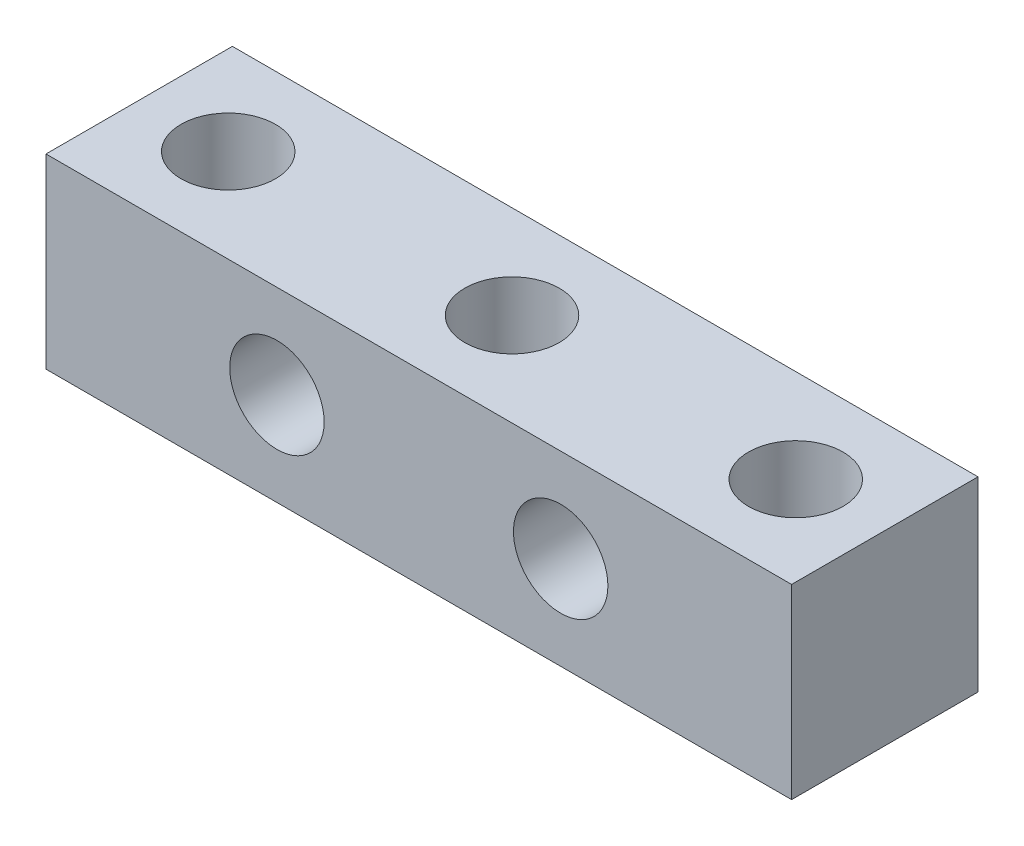
ISO-10303-21;
HEADER;
FILE_DESCRIPTION(('STEP AP214'),'2;1');
FILE_NAME('part.step','',(''),(''),'','','');
FILE_SCHEMA(('AUTOMOTIVE_DESIGN { 1 0 10303 214 1 1 1 1 }'));
ENDSEC;
DATA;
#1=APPLICATION_CONTEXT('core data for automotive mechanical design processes');
#2=APPLICATION_PROTOCOL_DEFINITION('international standard','automotive_design',2000,#1);
#3=PRODUCT_CONTEXT('',#1,'mechanical');
#4=PRODUCT('Part','Part','',(#3));
#5=PRODUCT_RELATED_PRODUCT_CATEGORY('part','',(#4));
#6=PRODUCT_DEFINITION_FORMATION('','',#4);
#7=PRODUCT_DEFINITION_CONTEXT('part definition',#1,'design');
#8=PRODUCT_DEFINITION('design','',#6,#7);
#9=PRODUCT_DEFINITION_SHAPE('','',#8);
#10=(LENGTH_UNIT() NAMED_UNIT(*) SI_UNIT(.MILLI.,.METRE.));
#11=(NAMED_UNIT(*) PLANE_ANGLE_UNIT() SI_UNIT($,.RADIAN.));
#12=(NAMED_UNIT(*) SI_UNIT($,.STERADIAN.) SOLID_ANGLE_UNIT());
#13=UNCERTAINTY_MEASURE_WITH_UNIT(LENGTH_MEASURE(1.E-05),#10,'distance_accuracy_value','');
#14=(GEOMETRIC_REPRESENTATION_CONTEXT(3) GLOBAL_UNCERTAINTY_ASSIGNED_CONTEXT((#13)) GLOBAL_UNIT_ASSIGNED_CONTEXT((#10,
#11,#12)) REPRESENTATION_CONTEXT('',''));
#15=CARTESIAN_POINT('',(0.,0.,0.));
#16=DIRECTION('',(0.,0.,1.));
#17=DIRECTION('',(1.,0.,0.));
#18=AXIS2_PLACEMENT_3D('',#15,#16,#17);
#19=CARTESIAN_POINT('',(38.1,4.7625,4.7625));
#20=DIRECTION('',(0.,0.,-1.));
#21=DIRECTION('',(0.,1.,0.));
#22=AXIS2_PLACEMENT_3D('',#19,#20,#21);
#23=PLANE('',#22);
#24=CARTESIAN_POINT('',(11.8,0.,4.7625));
#25=DIRECTION('',(0.,0.,1.));
#26=DIRECTION('',(1.,0.,0.));
#27=AXIS2_PLACEMENT_3D('',#24,#25,#26);
#28=CIRCLE('',#27,2.41299999999999);
#29=CARTESIAN_POINT('',(14.213,0.,4.7625));
#30=VERTEX_POINT('',#29);
#31=EDGE_CURVE('E137',#30,#30,#28,.T.);
#32=ORIENTED_EDGE('',*,*,#31,.F.);
#33=EDGE_LOOP('',(#32));
#34=FACE_BOUND('',#33,.T.);
#35=CARTESIAN_POINT('',(26.3,0.,4.7625));
#36=DIRECTION('',(0.,0.,1.));
#37=DIRECTION('',(1.,0.,0.));
#38=AXIS2_PLACEMENT_3D('',#35,#36,#37);
#39=CIRCLE('',#38,2.41299999999999);
#40=CARTESIAN_POINT('',(28.713,0.,4.7625));
#41=VERTEX_POINT('',#40);
#42=EDGE_CURVE('E131',#41,#41,#39,.T.);
#43=ORIENTED_EDGE('',*,*,#42,.F.);
#44=EDGE_LOOP('',(#43));
#45=FACE_BOUND('',#44,.T.);
#46=DIRECTION('',(0.,-1.,0.));
#47=VECTOR('',#46,1.);
#48=CARTESIAN_POINT('',(0.,4.7625,4.7625));
#49=LINE('',#48,#47);
#50=CARTESIAN_POINT('',(0.,4.7625,4.7625));
#51=VERTEX_POINT('',#50);
#52=CARTESIAN_POINT('',(0.,-4.7625,4.7625));
#53=VERTEX_POINT('',#52);
#54=EDGE_CURVE('E97',#51,#53,#49,.T.);
#55=ORIENTED_EDGE('',*,*,#54,.T.);
#56=DIRECTION('',(-1.,0.,0.));
#57=VECTOR('',#56,1.);
#58=CARTESIAN_POINT('',(38.1,-4.7625,4.7625));
#59=LINE('',#58,#57);
#60=CARTESIAN_POINT('',(38.1,-4.7625,4.7625));
#61=VERTEX_POINT('',#60);
#62=EDGE_CURVE('E11',#61,#53,#59,.T.);
#63=ORIENTED_EDGE('',*,*,#62,.F.);
#64=DIRECTION('',(0.,-1.,0.));
#65=VECTOR('',#64,1.);
#66=CARTESIAN_POINT('',(38.1,4.7625,4.7625));
#67=LINE('',#66,#65);
#68=CARTESIAN_POINT('',(38.1,4.7625,4.7625));
#69=VERTEX_POINT('',#68);
#70=EDGE_CURVE('E85',#69,#61,#67,.T.);
#71=ORIENTED_EDGE('',*,*,#70,.F.);
#72=DIRECTION('',(-1.,0.,0.));
#73=VECTOR('',#72,1.);
#74=CARTESIAN_POINT('',(38.1,4.7625,4.7625));
#75=LINE('',#74,#73);
#76=EDGE_CURVE('E93',#69,#51,#75,.T.);
#77=ORIENTED_EDGE('',*,*,#76,.T.);
#78=EDGE_LOOP('',(#55,#63,#71,#77));
#79=FACE_BOUND('',#78,.T.);
#80=ADVANCED_FACE('F34',(#34,#45,#79),#23,.F.);
#81=CARTESIAN_POINT('',(38.1,-4.7625,4.7625));
#82=DIRECTION('',(0.,1.,0.));
#83=DIRECTION('',(0.,0.,1.));
#84=AXIS2_PLACEMENT_3D('',#81,#82,#83);
#85=PLANE('',#84);
#86=CARTESIAN_POINT('',(4.55,-4.7625,0.));
#87=DIRECTION('',(0.,1.,0.));
#88=DIRECTION('',(0.,0.,1.));
#89=AXIS2_PLACEMENT_3D('',#86,#87,#88);
#90=CIRCLE('',#89,2.413);
#91=CARTESIAN_POINT('',(4.55,-4.7625,2.413));
#92=VERTEX_POINT('',#91);
#93=EDGE_CURVE('E122',#92,#92,#90,.T.);
#94=ORIENTED_EDGE('',*,*,#93,.T.);
#95=EDGE_LOOP('',(#94));
#96=FACE_BOUND('',#95,.T.);
#97=CARTESIAN_POINT('',(19.05,-4.7625,0.));
#98=DIRECTION('',(0.,1.,0.));
#99=DIRECTION('',(0.,0.,1.));
#100=AXIS2_PLACEMENT_3D('',#97,#98,#99);
#101=CIRCLE('',#100,2.413);
#102=CARTESIAN_POINT('',(19.05,-4.7625,2.413));
#103=VERTEX_POINT('',#102);
#104=EDGE_CURVE('E116',#103,#103,#101,.T.);
#105=ORIENTED_EDGE('',*,*,#104,.T.);
#106=EDGE_LOOP('',(#105));
#107=FACE_BOUND('',#106,.T.);
#108=CARTESIAN_POINT('',(33.55,-4.7625,0.));
#109=DIRECTION('',(0.,1.,0.));
#110=DIRECTION('',(0.,0.,1.));
#111=AXIS2_PLACEMENT_3D('',#108,#109,#110);
#112=CIRCLE('',#111,2.413);
#113=CARTESIAN_POINT('',(33.55,-4.7625,2.413));
#114=VERTEX_POINT('',#113);
#115=EDGE_CURVE('E100',#114,#114,#112,.T.);
#116=ORIENTED_EDGE('',*,*,#115,.T.);
#117=EDGE_LOOP('',(#116));
#118=FACE_BOUND('',#117,.T.);
#119=DIRECTION('',(0.,0.,-1.));
#120=VECTOR('',#119,1.);
#121=CARTESIAN_POINT('',(0.,-4.7625,4.7625));
#122=LINE('',#121,#120);
#123=CARTESIAN_POINT('',(0.,-4.7625,-4.7625));
#124=VERTEX_POINT('',#123);
#125=EDGE_CURVE('E89',#53,#124,#122,.T.);
#126=ORIENTED_EDGE('',*,*,#125,.T.);
#127=DIRECTION('',(-1.,0.,0.));
#128=VECTOR('',#127,1.);
#129=CARTESIAN_POINT('',(38.1,-4.7625,-4.7625));
#130=LINE('',#129,#128);
#131=CARTESIAN_POINT('',(38.1,-4.7625,-4.7625));
#132=VERTEX_POINT('',#131);
#133=EDGE_CURVE('E42',#132,#124,#130,.T.);
#134=ORIENTED_EDGE('',*,*,#133,.F.);
#135=DIRECTION('',(0.,0.,-1.));
#136=VECTOR('',#135,1.);
#137=CARTESIAN_POINT('',(38.1,-4.7625,4.7625));
#138=LINE('',#137,#136);
#139=EDGE_CURVE('E80',#61,#132,#138,.T.);
#140=ORIENTED_EDGE('',*,*,#139,.F.);
#141=ORIENTED_EDGE('',*,*,#62,.T.);
#142=EDGE_LOOP('',(#126,#134,#140,#141));
#143=FACE_BOUND('',#142,.T.);
#144=ADVANCED_FACE('F88',(#96,#107,#118,#143),#85,.F.);
#145=CARTESIAN_POINT('',(38.1,4.7625,-4.7625));
#146=DIRECTION('',(0.,0.,1.));
#147=DIRECTION('',(1.,0.,0.));
#148=AXIS2_PLACEMENT_3D('',#145,#146,#147);
#149=PLANE('',#148);
#150=CARTESIAN_POINT('',(11.8,0.,-4.7625));
#151=DIRECTION('',(0.,0.,1.));
#152=DIRECTION('',(1.,0.,0.));
#153=AXIS2_PLACEMENT_3D('',#150,#151,#152);
#154=CIRCLE('',#153,2.413);
#155=CARTESIAN_POINT('',(14.213,0.,-4.7625));
#156=VERTEX_POINT('',#155);
#157=EDGE_CURVE('E134',#156,#156,#154,.T.);
#158=ORIENTED_EDGE('',*,*,#157,.T.);
#159=EDGE_LOOP('',(#158));
#160=FACE_BOUND('',#159,.T.);
#161=CARTESIAN_POINT('',(26.3,0.,-4.7625));
#162=DIRECTION('',(0.,0.,1.));
#163=DIRECTION('',(1.,0.,0.));
#164=AXIS2_PLACEMENT_3D('',#161,#162,#163);
#165=CIRCLE('',#164,2.413);
#166=CARTESIAN_POINT('',(28.713,0.,-4.7625));
#167=VERTEX_POINT('',#166);
#168=EDGE_CURVE('E128',#167,#167,#165,.T.);
#169=ORIENTED_EDGE('',*,*,#168,.T.);
#170=EDGE_LOOP('',(#169));
#171=FACE_BOUND('',#170,.T.);
#172=DIRECTION('',(0.,1.,0.));
#173=VECTOR('',#172,1.);
#174=CARTESIAN_POINT('',(0.,4.7625,-4.7625));
#175=LINE('',#174,#173);
#176=CARTESIAN_POINT('',(0.,4.7625,-4.7625));
#177=VERTEX_POINT('',#176);
#178=EDGE_CURVE('E67',#124,#177,#175,.T.);
#179=ORIENTED_EDGE('',*,*,#178,.T.);
#180=DIRECTION('',(-1.,0.,0.));
#181=VECTOR('',#180,1.);
#182=CARTESIAN_POINT('',(38.1,4.7625,-4.7625));
#183=LINE('',#182,#181);
#184=CARTESIAN_POINT('',(38.1,4.7625,-4.7625));
#185=VERTEX_POINT('',#184);
#186=EDGE_CURVE('E90',#185,#177,#183,.T.);
#187=ORIENTED_EDGE('',*,*,#186,.F.);
#188=DIRECTION('',(0.,1.,0.));
#189=VECTOR('',#188,1.);
#190=CARTESIAN_POINT('',(38.1,4.7625,-4.7625));
#191=LINE('',#190,#189);
#192=EDGE_CURVE('E83',#132,#185,#191,.T.);
#193=ORIENTED_EDGE('',*,*,#192,.F.);
#194=ORIENTED_EDGE('',*,*,#133,.T.);
#195=EDGE_LOOP('',(#179,#187,#193,#194));
#196=FACE_BOUND('',#195,.T.);
#197=ADVANCED_FACE('F91',(#160,#171,#196),#149,.F.);
#198=CARTESIAN_POINT('',(38.1,4.7625,4.7625));
#199=DIRECTION('',(0.,-1.,0.));
#200=DIRECTION('',(0.,0.,-1.));
#201=AXIS2_PLACEMENT_3D('',#198,#199,#200);
#202=PLANE('',#201);
#203=CARTESIAN_POINT('',(4.55,4.7625,0.));
#204=DIRECTION('',(0.,1.,0.));
#205=DIRECTION('',(0.,0.,1.));
#206=AXIS2_PLACEMENT_3D('',#203,#204,#205);
#207=CIRCLE('',#206,2.41299999999999);
#208=CARTESIAN_POINT('',(4.55,4.7625,2.41299999999999));
#209=VERTEX_POINT('',#208);
#210=EDGE_CURVE('E125',#209,#209,#207,.T.);
#211=ORIENTED_EDGE('',*,*,#210,.F.);
#212=EDGE_LOOP('',(#211));
#213=FACE_BOUND('',#212,.T.);
#214=CARTESIAN_POINT('',(19.05,4.7625,0.));
#215=DIRECTION('',(0.,1.,0.));
#216=DIRECTION('',(0.,0.,1.));
#217=AXIS2_PLACEMENT_3D('',#214,#215,#216);
#218=CIRCLE('',#217,2.41299999999999);
#219=CARTESIAN_POINT('',(19.05,4.7625,2.41299999999999));
#220=VERTEX_POINT('',#219);
#221=EDGE_CURVE('E119',#220,#220,#218,.T.);
#222=ORIENTED_EDGE('',*,*,#221,.F.);
#223=EDGE_LOOP('',(#222));
#224=FACE_BOUND('',#223,.T.);
#225=CARTESIAN_POINT('',(33.55,4.7625,0.));
#226=DIRECTION('',(0.,1.,0.));
#227=DIRECTION('',(0.,0.,1.));
#228=AXIS2_PLACEMENT_3D('',#225,#226,#227);
#229=CIRCLE('',#228,2.41299999999999);
#230=CARTESIAN_POINT('',(33.55,4.7625,2.41299999999999));
#231=VERTEX_POINT('',#230);
#232=EDGE_CURVE('E113',#231,#231,#229,.T.);
#233=ORIENTED_EDGE('',*,*,#232,.F.);
#234=EDGE_LOOP('',(#233));
#235=FACE_BOUND('',#234,.T.);
#236=DIRECTION('',(0.,0.,1.));
#237=VECTOR('',#236,1.);
#238=CARTESIAN_POINT('',(0.,4.7625,4.7625));
#239=LINE('',#238,#237);
#240=EDGE_CURVE('E73',#177,#51,#239,.T.);
#241=ORIENTED_EDGE('',*,*,#240,.T.);
#242=ORIENTED_EDGE('',*,*,#76,.F.);
#243=DIRECTION('',(0.,0.,1.));
#244=VECTOR('',#243,1.);
#245=CARTESIAN_POINT('',(38.1,4.7625,4.7625));
#246=LINE('',#245,#244);
#247=EDGE_CURVE('E50',#185,#69,#246,.T.);
#248=ORIENTED_EDGE('',*,*,#247,.F.);
#249=ORIENTED_EDGE('',*,*,#186,.T.);
#250=EDGE_LOOP('',(#241,#242,#248,#249));
#251=FACE_BOUND('',#250,.T.);
#252=ADVANCED_FACE('F105',(#213,#224,#235,#251),#202,.F.);
#253=CARTESIAN_POINT('',(38.1,0.,0.));
#254=DIRECTION('',(1.,0.,0.));
#255=DIRECTION('',(0.,0.,-1.));
#256=AXIS2_PLACEMENT_3D('',#253,#254,#255);
#257=PLANE('',#256);
#258=ORIENTED_EDGE('',*,*,#70,.T.);
#259=ORIENTED_EDGE('',*,*,#139,.T.);
#260=ORIENTED_EDGE('',*,*,#192,.T.);
#261=ORIENTED_EDGE('',*,*,#247,.T.);
#262=EDGE_LOOP('',(#258,#259,#260,#261));
#263=FACE_BOUND('',#262,.T.);
#264=ADVANCED_FACE('F81',(#263),#257,.T.);
#265=CARTESIAN_POINT('',(0.,0.,0.));
#266=DIRECTION('',(1.,0.,0.));
#267=DIRECTION('',(0.,0.,-1.));
#268=AXIS2_PLACEMENT_3D('',#265,#266,#267);
#269=PLANE('',#268);
#270=ORIENTED_EDGE('',*,*,#54,.F.);
#271=ORIENTED_EDGE('',*,*,#240,.F.);
#272=ORIENTED_EDGE('',*,*,#178,.F.);
#273=ORIENTED_EDGE('',*,*,#125,.F.);
#274=EDGE_LOOP('',(#270,#271,#272,#273));
#275=FACE_BOUND('',#274,.T.);
#276=ADVANCED_FACE('F108',(#275),#269,.F.);
#277=CARTESIAN_POINT('',(33.55,4.7625,0.));
#278=DIRECTION('',(0.,1.,0.));
#279=DIRECTION('',(0.,0.,1.));
#280=AXIS2_PLACEMENT_3D('',#277,#278,#279);
#281=CYLINDRICAL_SURFACE('',#280,2.41299999999999);
#282=ORIENTED_EDGE('',*,*,#115,.F.);
#283=EDGE_LOOP('',(#282));
#284=FACE_BOUND('',#283,.T.);
#285=ORIENTED_EDGE('',*,*,#232,.T.);
#286=EDGE_LOOP('',(#285));
#287=FACE_BOUND('',#286,.T.);
#288=ADVANCED_FACE('F165',(#284,#287),#281,.F.);
#289=CARTESIAN_POINT('',(19.05,4.7625,0.));
#290=DIRECTION('',(0.,1.,0.));
#291=DIRECTION('',(0.,0.,1.));
#292=AXIS2_PLACEMENT_3D('',#289,#290,#291);
#293=CYLINDRICAL_SURFACE('',#292,2.41299999999999);
#294=ORIENTED_EDGE('',*,*,#104,.F.);
#295=EDGE_LOOP('',(#294));
#296=FACE_BOUND('',#295,.T.);
#297=ORIENTED_EDGE('',*,*,#221,.T.);
#298=EDGE_LOOP('',(#297));
#299=FACE_BOUND('',#298,.T.);
#300=ADVANCED_FACE('F158',(#296,#299),#293,.F.);
#301=CARTESIAN_POINT('',(4.55,4.7625,0.));
#302=DIRECTION('',(0.,1.,0.));
#303=DIRECTION('',(0.,0.,1.));
#304=AXIS2_PLACEMENT_3D('',#301,#302,#303);
#305=CYLINDRICAL_SURFACE('',#304,2.41299999999999);
#306=ORIENTED_EDGE('',*,*,#93,.F.);
#307=EDGE_LOOP('',(#306));
#308=FACE_BOUND('',#307,.T.);
#309=ORIENTED_EDGE('',*,*,#210,.T.);
#310=EDGE_LOOP('',(#309));
#311=FACE_BOUND('',#310,.T.);
#312=ADVANCED_FACE('F149',(#308,#311),#305,.F.);
#313=CARTESIAN_POINT('',(26.3,0.,4.7625));
#314=DIRECTION('',(0.,0.,1.));
#315=DIRECTION('',(1.,0.,0.));
#316=AXIS2_PLACEMENT_3D('',#313,#314,#315);
#317=CYLINDRICAL_SURFACE('',#316,2.41299999999999);
#318=ORIENTED_EDGE('',*,*,#168,.F.);
#319=EDGE_LOOP('',(#318));
#320=FACE_BOUND('',#319,.T.);
#321=ORIENTED_EDGE('',*,*,#42,.T.);
#322=EDGE_LOOP('',(#321));
#323=FACE_BOUND('',#322,.T.);
#324=ADVANCED_FACE('F147',(#320,#323),#317,.F.);
#325=CARTESIAN_POINT('',(11.8,0.,4.7625));
#326=DIRECTION('',(0.,0.,1.));
#327=DIRECTION('',(1.,0.,0.));
#328=AXIS2_PLACEMENT_3D('',#325,#326,#327);
#329=CYLINDRICAL_SURFACE('',#328,2.41299999999999);
#330=ORIENTED_EDGE('',*,*,#157,.F.);
#331=EDGE_LOOP('',(#330));
#332=FACE_BOUND('',#331,.T.);
#333=ORIENTED_EDGE('',*,*,#31,.T.);
#334=EDGE_LOOP('',(#333));
#335=FACE_BOUND('',#334,.T.);
#336=ADVANCED_FACE('F141',(#332,#335),#329,.F.);
#337=CLOSED_SHELL('',(#80,#144,#197,#252,#264,#276,#288,#300,#312,#324,#336));
#338=MANIFOLD_SOLID_BREP('B2',#337);
#339=ADVANCED_BREP_SHAPE_REPRESENTATION('',(#18,#338),#14);
#340=SHAPE_DEFINITION_REPRESENTATION(#9,#339);
ENDSEC;
END-ISO-10303-21;
